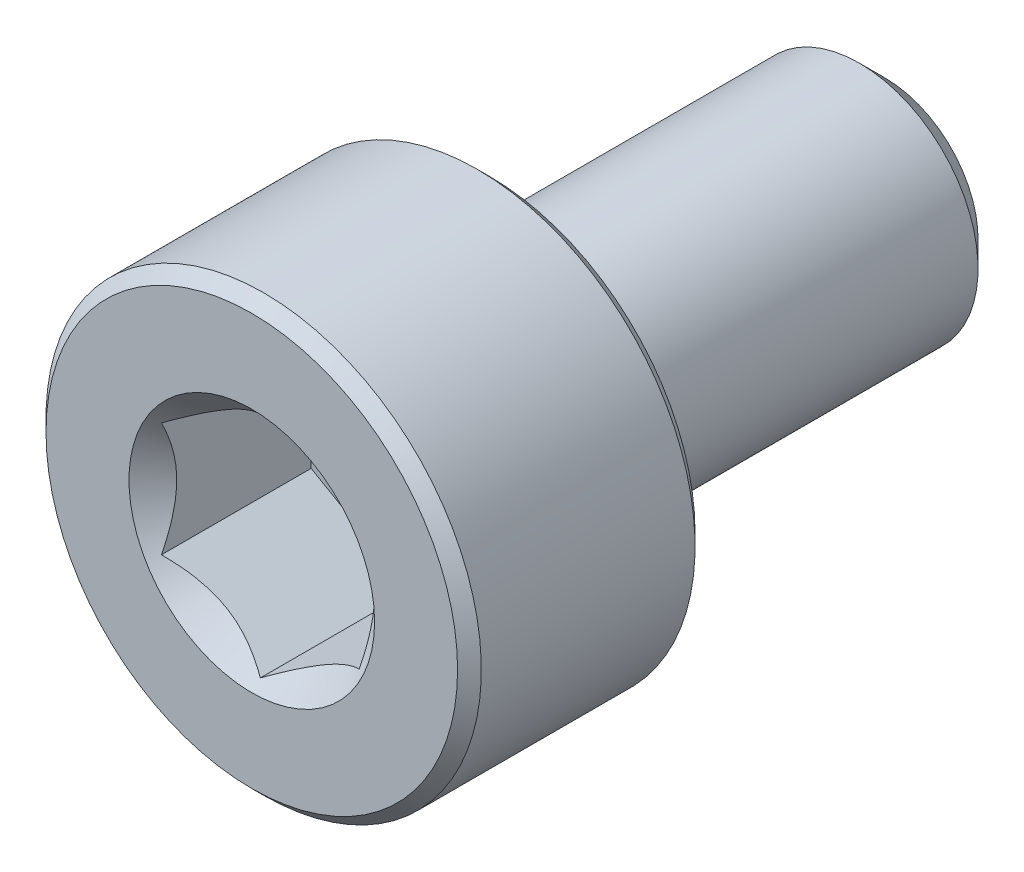
ISO-10303-21;
HEADER;
FILE_DESCRIPTION(('STEP AP214'),'2;1');
FILE_NAME('part.step','',(''),(''),'','','');
FILE_SCHEMA(('AUTOMOTIVE_DESIGN { 1 0 10303 214 1 1 1 1 }'));
ENDSEC;
DATA;
#1=APPLICATION_CONTEXT('core data for automotive mechanical design processes');
#2=APPLICATION_PROTOCOL_DEFINITION('international standard','automotive_design',2000,#1);
#3=PRODUCT_CONTEXT('',#1,'mechanical');
#4=PRODUCT('Part','Part','',(#3));
#5=PRODUCT_RELATED_PRODUCT_CATEGORY('part','',(#4));
#6=PRODUCT_DEFINITION_FORMATION('','',#4);
#7=PRODUCT_DEFINITION_CONTEXT('part definition',#1,'design');
#8=PRODUCT_DEFINITION('design','',#6,#7);
#9=PRODUCT_DEFINITION_SHAPE('','',#8);
#10=(LENGTH_UNIT() NAMED_UNIT(*) SI_UNIT(.MILLI.,.METRE.));
#11=(NAMED_UNIT(*) PLANE_ANGLE_UNIT() SI_UNIT($,.RADIAN.));
#12=(NAMED_UNIT(*) SI_UNIT($,.STERADIAN.) SOLID_ANGLE_UNIT());
#13=UNCERTAINTY_MEASURE_WITH_UNIT(LENGTH_MEASURE(1.E-05),#10,'distance_accuracy_value','');
#14=(GEOMETRIC_REPRESENTATION_CONTEXT(3) GLOBAL_UNCERTAINTY_ASSIGNED_CONTEXT((#13)) GLOBAL_UNIT_ASSIGNED_CONTEXT((#10,
#11,#12)) REPRESENTATION_CONTEXT('',''));
#15=CARTESIAN_POINT('',(0.,0.,0.));
#16=DIRECTION('',(0.,0.,1.));
#17=DIRECTION('',(1.,0.,0.));
#18=AXIS2_PLACEMENT_3D('',#15,#16,#17);
#19=CARTESIAN_POINT('',(0.,1.17524047358084,-4.));
#20=DIRECTION('',(0.,0.,-1.));
#21=DIRECTION('',(0.,1.,0.));
#22=AXIS2_PLACEMENT_3D('',#19,#20,#21);
#23=PLANE('',#22);
#24=CARTESIAN_POINT('',(0.,0.,-4.));
#25=DIRECTION('',(0.,0.,-1.));
#26=DIRECTION('',(0.,1.,0.));
#27=AXIS2_PLACEMENT_3D('',#24,#25,#26);
#28=CIRCLE('',#27,1.17524047358084);
#29=CARTESIAN_POINT('',(0.,1.17524047358084,-4.));
#30=VERTEX_POINT('',#29);
#31=EDGE_CURVE('E57',#30,#30,#28,.T.);
#32=ORIENTED_EDGE('',*,*,#31,.T.);
#33=EDGE_LOOP('',(#32));
#34=FACE_BOUND('',#33,.T.);
#35=ADVANCED_FACE('F43',(#34),#23,.T.);
#36=CARTESIAN_POINT('',(0.,0.,-4.));
#37=DIRECTION('',(0.,0.,1.));
#38=DIRECTION('',(0.,-1.,0.));
#39=AXIS2_PLACEMENT_3D('',#36,#37,#38);
#40=CONICAL_SURFACE('',#39,1.17524047358084,0.785398163397446);
#41=CARTESIAN_POINT('',(0.,0.,-3.67524047358083));
#42=DIRECTION('',(0.,0.,-1.));
#43=DIRECTION('',(0.,1.,0.));
#44=AXIS2_PLACEMENT_3D('',#41,#42,#43);
#45=CIRCLE('',#44,1.5);
#46=CARTESIAN_POINT('',(0.,1.5,-3.67524047358083));
#47=VERTEX_POINT('',#46);
#48=EDGE_CURVE('E175',#47,#47,#45,.T.);
#49=ORIENTED_EDGE('',*,*,#48,.T.);
#50=EDGE_LOOP('',(#49));
#51=FACE_BOUND('',#50,.T.);
#52=ORIENTED_EDGE('',*,*,#31,.F.);
#53=EDGE_LOOP('',(#52));
#54=FACE_BOUND('',#53,.T.);
#55=ADVANCED_FACE('F183',(#51,#54),#40,.T.);
#56=CARTESIAN_POINT('',(0.,0.,-4.));
#57=DIRECTION('',(0.,0.,-1.));
#58=DIRECTION('',(0.,1.,0.));
#59=AXIS2_PLACEMENT_3D('',#56,#57,#58);
#60=CYLINDRICAL_SURFACE('',#59,1.5);
#61=CARTESIAN_POINT('',(0.,0.,0.85));
#62=DIRECTION('',(0.,0.,-1.));
#63=DIRECTION('',(0.,1.,0.));
#64=AXIS2_PLACEMENT_3D('',#61,#62,#63);
#65=CIRCLE('',#64,1.5);
#66=CARTESIAN_POINT('',(0.,1.5,0.85));
#67=VERTEX_POINT('',#66);
#68=EDGE_CURVE('E171',#67,#67,#65,.T.);
#69=ORIENTED_EDGE('',*,*,#68,.T.);
#70=EDGE_LOOP('',(#69));
#71=FACE_BOUND('',#70,.T.);
#72=ORIENTED_EDGE('',*,*,#48,.F.);
#73=EDGE_LOOP('',(#72));
#74=FACE_BOUND('',#73,.T.);
#75=ADVANCED_FACE('F185',(#71,#74),#60,.T.);
#76=CARTESIAN_POINT('',(0.,0.,0.85));
#77=DIRECTION('',(0.,0.,-1.));
#78=DIRECTION('',(0.,1.,0.));
#79=AXIS2_PLACEMENT_3D('',#76,#77,#78);
#80=TOROIDAL_SURFACE('',#79,1.65,0.149999999999999);
#81=CARTESIAN_POINT('',(0.,0.,0.999999999999999));
#82=DIRECTION('',(0.,0.,-1.));
#83=DIRECTION('',(0.,1.,0.));
#84=AXIS2_PLACEMENT_3D('',#81,#82,#83);
#85=CIRCLE('',#84,1.65);
#86=CARTESIAN_POINT('',(0.,1.65,0.999999999999999));
#87=VERTEX_POINT('',#86);
#88=EDGE_CURVE('E167',#87,#87,#85,.T.);
#89=ORIENTED_EDGE('',*,*,#88,.T.);
#90=EDGE_LOOP('',(#89));
#91=FACE_BOUND('',#90,.T.);
#92=ORIENTED_EDGE('',*,*,#68,.F.);
#93=EDGE_LOOP('',(#92));
#94=FACE_BOUND('',#93,.T.);
#95=ADVANCED_FACE('F191',(#91,#94),#80,.F.);
#96=CARTESIAN_POINT('',(0.,2.6,1.));
#97=DIRECTION('',(0.,0.,-1.));
#98=DIRECTION('',(0.,1.,0.));
#99=AXIS2_PLACEMENT_3D('',#96,#97,#98);
#100=PLANE('',#99);
#101=CARTESIAN_POINT('',(0.,0.,1.));
#102=DIRECTION('',(0.,0.,-1.));
#103=DIRECTION('',(0.,1.,0.));
#104=AXIS2_PLACEMENT_3D('',#101,#102,#103);
#105=CIRCLE('',#104,2.6);
#106=CARTESIAN_POINT('',(0.,2.6,1.));
#107=VERTEX_POINT('',#106);
#108=EDGE_CURVE('E163',#107,#107,#105,.T.);
#109=ORIENTED_EDGE('',*,*,#108,.T.);
#110=EDGE_LOOP('',(#109));
#111=FACE_BOUND('',#110,.T.);
#112=ORIENTED_EDGE('',*,*,#88,.F.);
#113=EDGE_LOOP('',(#112));
#114=FACE_BOUND('',#113,.T.);
#115=ADVANCED_FACE('F197',(#111,#114),#100,.T.);
#116=CARTESIAN_POINT('',(0.,0.,1.));
#117=DIRECTION('',(0.,0.,1.));
#118=DIRECTION('',(0.,-1.,0.));
#119=AXIS2_PLACEMENT_3D('',#116,#117,#118);
#120=CONICAL_SURFACE('',#119,2.6,0.785398163397448);
#121=CARTESIAN_POINT('',(0.,0.,1.15));
#122=DIRECTION('',(0.,0.,-1.));
#123=DIRECTION('',(0.,1.,0.));
#124=AXIS2_PLACEMENT_3D('',#121,#122,#123);
#125=CIRCLE('',#124,2.75);
#126=CARTESIAN_POINT('',(0.,2.75,1.15));
#127=VERTEX_POINT('',#126);
#128=EDGE_CURVE('E159',#127,#127,#125,.T.);
#129=ORIENTED_EDGE('',*,*,#128,.T.);
#130=EDGE_LOOP('',(#129));
#131=FACE_BOUND('',#130,.T.);
#132=ORIENTED_EDGE('',*,*,#108,.F.);
#133=EDGE_LOOP('',(#132));
#134=FACE_BOUND('',#133,.T.);
#135=ADVANCED_FACE('F201',(#131,#134),#120,.T.);
#136=CARTESIAN_POINT('',(0.,0.,-4.));
#137=DIRECTION('',(0.,0.,-1.));
#138=DIRECTION('',(0.,1.,0.));
#139=AXIS2_PLACEMENT_3D('',#136,#137,#138);
#140=CYLINDRICAL_SURFACE('',#139,2.75);
#141=CARTESIAN_POINT('',(0.,0.,3.85));
#142=DIRECTION('',(0.,0.,-1.));
#143=DIRECTION('',(0.,1.,0.));
#144=AXIS2_PLACEMENT_3D('',#141,#142,#143);
#145=CIRCLE('',#144,2.75);
#146=CARTESIAN_POINT('',(0.,2.75,3.85));
#147=VERTEX_POINT('',#146);
#148=EDGE_CURVE('E155',#147,#147,#145,.T.);
#149=ORIENTED_EDGE('',*,*,#148,.T.);
#150=EDGE_LOOP('',(#149));
#151=FACE_BOUND('',#150,.T.);
#152=ORIENTED_EDGE('',*,*,#128,.F.);
#153=EDGE_LOOP('',(#152));
#154=FACE_BOUND('',#153,.T.);
#155=ADVANCED_FACE('F205',(#151,#154),#140,.T.);
#156=CARTESIAN_POINT('',(0.,0.,3.85));
#157=DIRECTION('',(0.,0.,-1.));
#158=DIRECTION('',(0.,1.,0.));
#159=AXIS2_PLACEMENT_3D('',#156,#157,#158);
#160=CONICAL_SURFACE('',#159,2.75,0.785398163397451);
#161=CARTESIAN_POINT('',(0.,0.,4.));
#162=DIRECTION('',(0.,0.,-1.));
#163=DIRECTION('',(0.,1.,0.));
#164=AXIS2_PLACEMENT_3D('',#161,#162,#163);
#165=CIRCLE('',#164,2.6);
#166=CARTESIAN_POINT('',(0.,2.6,4.));
#167=VERTEX_POINT('',#166);
#168=EDGE_CURVE('E151',#167,#167,#165,.T.);
#169=ORIENTED_EDGE('',*,*,#168,.T.);
#170=EDGE_LOOP('',(#169));
#171=FACE_BOUND('',#170,.T.);
#172=ORIENTED_EDGE('',*,*,#148,.F.);
#173=EDGE_LOOP('',(#172));
#174=FACE_BOUND('',#173,.T.);
#175=ADVANCED_FACE('F209',(#171,#174),#160,.T.);
#176=CARTESIAN_POINT('',(0.,0.,4.));
#177=DIRECTION('',(0.,0.,1.));
#178=DIRECTION('',(0.,-1.,0.));
#179=AXIS2_PLACEMENT_3D('',#176,#177,#178);
#180=PLANE('',#179);
#181=CARTESIAN_POINT('',(0.,0.,4.));
#182=DIRECTION('',(0.,0.,1.));
#183=DIRECTION('',(1.,0.,0.));
#184=AXIS2_PLACEMENT_3D('',#181,#182,#183);
#185=CIRCLE('',#184,1.55162884844712);
#186=CARTESIAN_POINT('',(1.55162884844712,0.,4.));
#187=VERTEX_POINT('',#186);
#188=EDGE_CURVE('E117',#187,#187,#185,.T.);
#189=ORIENTED_EDGE('',*,*,#188,.F.);
#190=EDGE_LOOP('',(#189));
#191=FACE_BOUND('',#190,.T.);
#192=ORIENTED_EDGE('',*,*,#168,.F.);
#193=EDGE_LOOP('',(#192));
#194=FACE_BOUND('',#193,.T.);
#195=ADVANCED_FACE('F213',(#191,#194),#180,.T.);
#196=CARTESIAN_POINT('',(0.,0.,4.));
#197=DIRECTION('',(0.,0.,1.));
#198=DIRECTION('',(1.,0.,0.));
#199=AXIS2_PLACEMENT_3D('',#196,#197,#198);
#200=CONICAL_SURFACE('',#199,1.55162884844712,0.78539816339745);
#201=ORIENTED_EDGE('',*,*,#188,.T.);
#202=EDGE_LOOP('',(#201));
#203=FACE_BOUND('',#202,.T.);
#204=CARTESIAN_POINT('',(-0.000199999999999194,-1.4434911430279,3.89186230843608));
#205=CARTESIAN_POINT('',(0.0427751670715876,-1.41867941875065,3.86706849258205));
#206=CARTESIAN_POINT('',(0.0864690047459489,-1.39345276980743,3.84373055894563));
#207=CARTESIAN_POINT('',(0.175565930841943,-1.34201263554194,3.80099882861148));
#208=CARTESIAN_POINT('',(0.220977498357065,-1.31579425481276,3.78162881688736));
#209=CARTESIAN_POINT('',(0.312547820935261,-1.26292610442246,3.74844730794042));
#210=CARTESIAN_POINT('',(0.358683240175886,-1.23628980770471,3.7345523835796));
#211=CARTESIAN_POINT('',(0.451970080407593,-1.18243062538508,3.71314410668758));
#212=CARTESIAN_POINT('',(0.499118649136381,-1.15520938653761,3.70561476609373));
#213=CARTESIAN_POINT('',(0.580373556887253,-1.10829684367467,3.69882132257765));
#214=CARTESIAN_POINT('',(0.614374876627942,-1.08866617256958,3.6978153836313));
#215=CARTESIAN_POINT('',(0.682317764432478,-1.04943932800611,3.69950823943826));
#216=CARTESIAN_POINT('',(0.716259317655658,-1.02984316311599,3.70220785174248));
#217=CARTESIAN_POINT('',(0.7838148564575,-0.990839954603499,3.71115575484332));
#218=CARTESIAN_POINT('',(0.817428507286776,-0.971433104248771,3.71740735042665));
#219=CARTESIAN_POINT('',(0.884094638217814,-0.932943395609905,3.73312250594085));
#220=CARTESIAN_POINT('',(0.917146871030296,-0.9138606800983,3.7425874446144));
#221=CARTESIAN_POINT('',(1.00179969160026,-0.864986351354568,3.77067821521453));
#222=CARTESIAN_POINT('',(1.05286649242964,-0.835502920149076,3.79141698197915));
#223=CARTESIAN_POINT('',(1.15300085411325,-0.777690319475909,3.83813395919842));
#224=CARTESIAN_POINT('',(1.20207431157827,-0.749357745598417,3.86409512047371));
#225=CARTESIAN_POINT('',(1.2502,-0.721572366433195,3.89186230843608));
#226=B_SPLINE_CURVE_WITH_KNOTS('',3,(#204,#205,#206,#207,#208,#209,#210,#211,#212,#213,#214,
#215,#216,#217,#218,#219,#220,#221,#222,#223,#224,#225),.UNSPECIFIED.,.F.,.F.,(4,2,2,2,2,2,2,2,
2,2,4),(0.,0.166533409618303,0.334037607289762,0.498880396489698,0.663307919240274,
0.780963963458827,0.898645970148453,1.01643764860773,1.1342799317155,1.32148652032141,
1.50809158792573),.UNSPECIFIED.);
#227=CARTESIAN_POINT('',(0.,-1.44337567297406,3.89174682452695));
#228=VERTEX_POINT('',#227);
#229=CARTESIAN_POINT('',(1.25,-0.721687836487032,3.89174682452695));
#230=VERTEX_POINT('',#229);
#231=EDGE_CURVE('E12',#228,#230,#226,.T.);
#232=ORIENTED_EDGE('',*,*,#231,.F.);
#233=CARTESIAN_POINT('',(-1.2502,-0.721572366433195,3.89186230843608));
#234=CARTESIAN_POINT('',(-1.20722483292841,-0.746384090710444,3.86706849258205));
#235=CARTESIAN_POINT('',(-1.16353099525405,-0.771610739653665,3.84373055894563));
#236=CARTESIAN_POINT('',(-1.07443406915806,-0.823050873919155,3.80099882861148));
#237=CARTESIAN_POINT('',(-1.02902250164294,-0.849269254648333,3.78162881688736));
#238=CARTESIAN_POINT('',(-0.93745217906474,-0.902137405038635,3.74844730794042));
#239=CARTESIAN_POINT('',(-0.891316759824115,-0.928773701756387,3.7345523835796));
#240=CARTESIAN_POINT('',(-0.798029919592408,-0.982632884076012,3.71314410668758));
#241=CARTESIAN_POINT('',(-0.75088135086362,-1.00985412292348,3.70561476609373));
#242=CARTESIAN_POINT('',(-0.669626443112748,-1.05676666578643,3.69882132257765));
#243=CARTESIAN_POINT('',(-0.635625123372059,-1.07639733689152,3.69781538363129));
#244=CARTESIAN_POINT('',(-0.567682235567523,-1.11562418145499,3.69950823943826));
#245=CARTESIAN_POINT('',(-0.533740682344343,-1.1352203463451,3.70220785174248));
#246=CARTESIAN_POINT('',(-0.466185143542501,-1.1742235548576,3.71115575484332));
#247=CARTESIAN_POINT('',(-0.432571492713225,-1.19363040521233,3.71740735042665));
#248=CARTESIAN_POINT('',(-0.365905361782187,-1.23212011385119,3.73312250594085));
#249=CARTESIAN_POINT('',(-0.332853128969705,-1.2512028293628,3.7425874446144));
#250=CARTESIAN_POINT('',(-0.248200308399736,-1.30007715810653,3.77067821521453));
#251=CARTESIAN_POINT('',(-0.197133507570362,-1.32956058931202,3.79141698197915));
#252=CARTESIAN_POINT('',(-0.0969991458867448,-1.38737318998519,3.83813395919842));
#253=CARTESIAN_POINT('',(-0.0479256884217301,-1.41570576386268,3.86409512047371));
#254=CARTESIAN_POINT('',(0.000200000000000837,-1.4434911430279,3.89186230843608));
#255=B_SPLINE_CURVE_WITH_KNOTS('',3,(#233,#234,#235,#236,#237,#238,#239,#240,#241,#242,#243,
#244,#245,#246,#247,#248,#249,#250,#251,#252,#253,#254),.UNSPECIFIED.,.F.,.F.,(4,2,2,2,2,2,2,2,
2,2,4),(0.,0.166533409618303,0.334037607289761,0.498880396489697,0.663307919240274,
0.780963963458826,0.898645970148452,1.01643764860773,1.13427993171549,1.32148652032141,
1.50809158792574),.UNSPECIFIED.);
#256=CARTESIAN_POINT('',(-1.25,-0.721687836487032,3.89174682452694));
#257=VERTEX_POINT('',#256);
#258=EDGE_CURVE('E102',#257,#228,#255,.T.);
#259=ORIENTED_EDGE('',*,*,#258,.F.);
#260=CARTESIAN_POINT('',(-1.25,-1.52022146239345,4.41651070319084));
#261=CARTESIAN_POINT('',(-1.25,-1.48354689134962,4.38818689718723));
#262=CARTESIAN_POINT('',(-1.25,-1.44667707589305,4.36011672093047));
#263=CARTESIAN_POINT('',(-1.25,-1.37246477804769,4.30459065501776));
#264=CARTESIAN_POINT('',(-1.25,-1.33512218721453,4.27713491044787));
#265=CARTESIAN_POINT('',(-1.25,-1.22171630832114,4.19545809771049));
#266=CARTESIAN_POINT('',(-1.25,-1.14482995781092,4.14236142511929));
#267=CARTESIAN_POINT('',(-1.25,-0.983056768942586,4.03734973416941));
#268=CARTESIAN_POINT('',(-1.25,-0.897974111811056,3.98573326925832));
#269=CARTESIAN_POINT('',(-1.25,-0.723462355215555,3.89078355108508));
#270=CARTESIAN_POINT('',(-1.25,-0.634049271919706,3.84742232185916));
#271=CARTESIAN_POINT('',(-1.25,-0.5005887711437,3.79435177040724));
#272=CARTESIAN_POINT('',(-1.25,-0.45869172620811,3.77926501327173));
#273=CARTESIAN_POINT('',(-1.25,-0.373815329706778,3.75244749770266));
#274=CARTESIAN_POINT('',(-1.25,-0.330835910419723,3.74071694982871));
#275=CARTESIAN_POINT('',(-1.25,-0.244810833071148,3.72144313304601));
#276=CARTESIAN_POINT('',(-1.25,-0.20178270746757,3.71382289169453));
#277=CARTESIAN_POINT('',(-1.25,-0.115176247984994,3.70293190707962));
#278=CARTESIAN_POINT('',(-1.25,-0.0715980347745594,3.6996602260857));
#279=CARTESIAN_POINT('',(-1.25,0.0136806197531968,3.69775210045869));
#280=CARTESIAN_POINT('',(-1.25,0.0553765370047049,3.69891205716704));
#281=CARTESIAN_POINT('',(-1.25,0.13844909645316,3.70533266388464));
#282=CARTESIAN_POINT('',(-1.25,0.179825709781942,3.71059368038276));
#283=CARTESIAN_POINT('',(-1.25,0.262662840763599,3.72500574721218));
#284=CARTESIAN_POINT('',(-1.25,0.304111120669651,3.73422600730023));
#285=CARTESIAN_POINT('',(-1.25,0.386089884230834,3.75604235623938));
#286=CARTESIAN_POINT('',(-1.25,0.426620414510369,3.76863827317792));
#287=CARTESIAN_POINT('',(-1.25,0.550794781768362,3.8120595916479));
#288=CARTESIAN_POINT('',(-1.25,0.632755591043412,3.84768282700966));
#289=CARTESIAN_POINT('',(-1.25,0.792852508946382,3.92696814455953));
#290=CARTESIAN_POINT('',(-1.25,0.870973935410876,3.97065844211049));
#291=CARTESIAN_POINT('',(-1.25,1.02031328199646,4.06088158787621));
#292=CARTESIAN_POINT('',(-1.25,1.09168171050215,4.10716845879521));
#293=CARTESIAN_POINT('',(-1.25,1.19682802849918,4.17876149953673));
#294=CARTESIAN_POINT('',(-1.25,1.2314248214359,4.20288582787532));
#295=CARTESIAN_POINT('',(-1.25,1.30014350643268,4.25178258410313));
#296=CARTESIAN_POINT('',(-1.25,1.33426552680451,4.2765548314612));
#297=CARTESIAN_POINT('',(-1.25,1.36818950249276,4.3015960474388));
#298=B_SPLINE_CURVE_WITH_KNOTS('',3,(#260,#261,#262,#263,#264,#265,#266,#267,#268,#269,#270,
#271,#272,#273,#274,#275,#276,#277,#278,#279,#280,#281,#282,#283,#284,#285,#286,#287,#288,#289,
#290,#291,#292,#293,#294,#295,#296,#297),.UNSPECIFIED.,.F.,.F.,(4,2,2,2,2,2,2,2,2,2,2,2,2,2,2,2,
2,2,4),(0.,0.139012369615044,0.278057225136918,0.55825950405377,0.856585057342474,
1.15388088887298,1.28736138903992,1.42085026158167,1.55174393609413,1.68260937990424,
1.80753647715252,1.93247473971975,2.05969207441603,2.18690293152764,2.45422704655832,
2.72250450232039,2.97756898823762,3.10409578574714,3.23058769667827),.UNSPECIFIED.);
#299=CARTESIAN_POINT('',(-1.25,0.721687836487032,3.89174682452694));
#300=VERTEX_POINT('',#299);
#301=EDGE_CURVE('E116',#300,#257,#298,.F.);
#302=ORIENTED_EDGE('',*,*,#301,.F.);
#303=CARTESIAN_POINT('',(0.000199999999999644,1.4434911430279,3.89186230843608));
#304=CARTESIAN_POINT('',(-0.0427751670715871,1.41867941875065,3.86706849258205));
#305=CARTESIAN_POINT('',(-0.0864690047459484,1.39345276980743,3.84373055894563));
#306=CARTESIAN_POINT('',(-0.175565930841942,1.34201263554194,3.80099882861148));
#307=CARTESIAN_POINT('',(-0.220977498357064,1.31579425481276,3.78162881688736));
#308=CARTESIAN_POINT('',(-0.31254782093526,1.26292610442246,3.74844730794042));
#309=CARTESIAN_POINT('',(-0.358683240175885,1.23628980770471,3.7345523835796));
#310=CARTESIAN_POINT('',(-0.451970080407592,1.18243062538508,3.71314410668758));
#311=CARTESIAN_POINT('',(-0.499118649136379,1.15520938653761,3.70561476609373));
#312=CARTESIAN_POINT('',(-0.580373556887252,1.10829684367467,3.69882132257765));
#313=CARTESIAN_POINT('',(-0.61437487662794,1.08866617256958,3.69781538363129));
#314=CARTESIAN_POINT('',(-0.682317764432477,1.04943932800611,3.69950823943826));
#315=CARTESIAN_POINT('',(-0.716259317655657,1.02984316311599,3.70220785174248));
#316=CARTESIAN_POINT('',(-0.783814856457499,0.990839954603499,3.71115575484332));
#317=CARTESIAN_POINT('',(-0.817428507286774,0.971433104248771,3.71740735042665));
#318=CARTESIAN_POINT('',(-0.884094638217812,0.932943395609906,3.73312250594085));
#319=CARTESIAN_POINT('',(-0.917146871030295,0.913860680098301,3.7425874446144));
#320=CARTESIAN_POINT('',(-1.00179969160026,0.864986351354568,3.77067821521453));
#321=CARTESIAN_POINT('',(-1.05286649242964,0.835502920149076,3.79141698197915));
#322=CARTESIAN_POINT('',(-1.15300085411325,0.777690319475908,3.83813395919842));
#323=CARTESIAN_POINT('',(-1.20207431157827,0.749357745598417,3.86409512047371));
#324=CARTESIAN_POINT('',(-1.2502,0.721572366433194,3.89186230843608));
#325=B_SPLINE_CURVE_WITH_KNOTS('',3,(#303,#304,#305,#306,#307,#308,#309,#310,#311,#312,#313,
#314,#315,#316,#317,#318,#319,#320,#321,#322,#323,#324),.UNSPECIFIED.,.F.,.F.,(4,2,2,2,2,2,2,2,
2,2,4),(0.,0.166533409618304,0.334037607289761,0.498880396489697,0.663307919240273,
0.780963963458825,0.898645970148451,1.01643764860773,1.13427993171549,1.32148652032141,
1.50809158792573),.UNSPECIFIED.);
#326=CARTESIAN_POINT('',(0.,1.44337567297406,3.89174682452694));
#327=VERTEX_POINT('',#326);
#328=EDGE_CURVE('E264',#327,#300,#325,.T.);
#329=ORIENTED_EDGE('',*,*,#328,.F.);
#330=CARTESIAN_POINT('',(1.2502,0.721572366433194,3.89186230843608));
#331=CARTESIAN_POINT('',(1.20722483292841,0.746384090710444,3.86706849258205));
#332=CARTESIAN_POINT('',(1.16353099525405,0.771610739653664,3.84373055894563));
#333=CARTESIAN_POINT('',(1.07443406915806,0.823050873919155,3.80099882861148));
#334=CARTESIAN_POINT('',(1.02902250164294,0.849269254648333,3.78162881688736));
#335=CARTESIAN_POINT('',(0.93745217906474,0.902137405038635,3.74844730794042));
#336=CARTESIAN_POINT('',(0.891316759824114,0.928773701756387,3.7345523835796));
#337=CARTESIAN_POINT('',(0.798029919592408,0.982632884076012,3.71314410668758));
#338=CARTESIAN_POINT('',(0.75088135086362,1.00985412292348,3.70561476609373));
#339=CARTESIAN_POINT('',(0.669626443112748,1.05676666578643,3.69882132257765));
#340=CARTESIAN_POINT('',(0.635625123372059,1.07639733689152,3.69781538363129));
#341=CARTESIAN_POINT('',(0.567682235567523,1.11562418145499,3.69950823943826));
#342=CARTESIAN_POINT('',(0.533740682344343,1.1352203463451,3.70220785174248));
#343=CARTESIAN_POINT('',(0.466185143542501,1.1742235548576,3.71115575484332));
#344=CARTESIAN_POINT('',(0.432571492713225,1.19363040521233,3.71740735042665));
#345=CARTESIAN_POINT('',(0.365905361782187,1.23212011385119,3.73312250594085));
#346=CARTESIAN_POINT('',(0.332853128969705,1.2512028293628,3.7425874446144));
#347=CARTESIAN_POINT('',(0.248200308399736,1.30007715810653,3.77067821521453));
#348=CARTESIAN_POINT('',(0.197133507570362,1.32956058931202,3.79141698197915));
#349=CARTESIAN_POINT('',(0.096999145886745,1.38737318998519,3.83813395919842));
#350=CARTESIAN_POINT('',(0.0479256884217302,1.41570576386268,3.86409512047371));
#351=CARTESIAN_POINT('',(-0.000200000000000388,1.4434911430279,3.89186230843608));
#352=B_SPLINE_CURVE_WITH_KNOTS('',3,(#330,#331,#332,#333,#334,#335,#336,#337,#338,#339,#340,
#341,#342,#343,#344,#345,#346,#347,#348,#349,#350,#351),.UNSPECIFIED.,.F.,.F.,(4,2,2,2,2,2,2,2,
2,2,4),(0.,0.166533409618304,0.334037607289762,0.498880396489698,0.663307919240274,
0.780963963458826,0.898645970148452,1.01643764860773,1.13427993171549,1.32148652032141,
1.50809158792574),.UNSPECIFIED.);
#353=CARTESIAN_POINT('',(1.25,0.721687836487032,3.89174682452695));
#354=VERTEX_POINT('',#353);
#355=EDGE_CURVE('E237',#354,#327,#352,.T.);
#356=ORIENTED_EDGE('',*,*,#355,.F.);
#357=CARTESIAN_POINT('',(1.25,-1.52022146239345,4.41651070319084));
#358=CARTESIAN_POINT('',(1.25,-1.48354689134962,4.38818689718723));
#359=CARTESIAN_POINT('',(1.25,-1.44667707589305,4.36011672093047));
#360=CARTESIAN_POINT('',(1.25,-1.37246477804769,4.30459065501776));
#361=CARTESIAN_POINT('',(1.25,-1.33512218721453,4.27713491044787));
#362=CARTESIAN_POINT('',(1.25,-1.22171630832114,4.19545809771049));
#363=CARTESIAN_POINT('',(1.25,-1.14482995781092,4.1423614251193));
#364=CARTESIAN_POINT('',(1.25,-0.983056768942587,4.03734973416941));
#365=CARTESIAN_POINT('',(1.25,-0.897974111811057,3.98573326925832));
#366=CARTESIAN_POINT('',(1.25,-0.723462355215556,3.89078355108508));
#367=CARTESIAN_POINT('',(1.25,-0.634049271919706,3.84742232185916));
#368=CARTESIAN_POINT('',(1.25,-0.500588771143699,3.79435177040724));
#369=CARTESIAN_POINT('',(1.25,-0.45869172620811,3.77926501327173));
#370=CARTESIAN_POINT('',(1.25,-0.373815329706778,3.75244749770266));
#371=CARTESIAN_POINT('',(1.25,-0.330835910419723,3.74071694982871));
#372=CARTESIAN_POINT('',(1.25,-0.244810833071148,3.72144313304601));
#373=CARTESIAN_POINT('',(1.25,-0.20178270746757,3.71382289169454));
#374=CARTESIAN_POINT('',(1.25,-0.115176247984994,3.70293190707962));
#375=CARTESIAN_POINT('',(1.25,-0.0715980347745594,3.6996602260857));
#376=CARTESIAN_POINT('',(1.25,0.0136806197531967,3.69775210045869));
#377=CARTESIAN_POINT('',(1.25,0.0553765370047049,3.69891205716704));
#378=CARTESIAN_POINT('',(1.25,0.13844909645316,3.70533266388464));
#379=CARTESIAN_POINT('',(1.25,0.179825709781942,3.71059368038276));
#380=CARTESIAN_POINT('',(1.25,0.262662840763599,3.72500574721218));
#381=CARTESIAN_POINT('',(1.25,0.304111120669651,3.73422600730023));
#382=CARTESIAN_POINT('',(1.25,0.386089884230834,3.75604235623938));
#383=CARTESIAN_POINT('',(1.25,0.426620414510369,3.76863827317792));
#384=CARTESIAN_POINT('',(1.25,0.550794781768362,3.8120595916479));
#385=CARTESIAN_POINT('',(1.25,0.632755591043412,3.84768282700966));
#386=CARTESIAN_POINT('',(1.25,0.792852508946383,3.92696814455953));
#387=CARTESIAN_POINT('',(1.25,0.870973935410876,3.97065844211049));
#388=CARTESIAN_POINT('',(1.25,1.02031328199646,4.06088158787621));
#389=CARTESIAN_POINT('',(1.25,1.09168171050215,4.10716845879521));
#390=CARTESIAN_POINT('',(1.25,1.19682802849918,4.17876149953674));
#391=CARTESIAN_POINT('',(1.25,1.2314248214359,4.20288582787532));
#392=CARTESIAN_POINT('',(1.25,1.30014350643268,4.25178258410313));
#393=CARTESIAN_POINT('',(1.25,1.33426552680451,4.2765548314612));
#394=CARTESIAN_POINT('',(1.25,1.36818950249276,4.3015960474388));
#395=B_SPLINE_CURVE_WITH_KNOTS('',3,(#357,#358,#359,#360,#361,#362,#363,#364,#365,#366,#367,
#368,#369,#370,#371,#372,#373,#374,#375,#376,#377,#378,#379,#380,#381,#382,#383,#384,#385,#386,
#387,#388,#389,#390,#391,#392,#393,#394),.UNSPECIFIED.,.F.,.F.,(4,2,2,2,2,2,2,2,2,2,2,2,2,2,2,2,
2,2,4),(0.,0.139012369615044,0.278057225136918,0.558259504053771,0.856585057342474,
1.15388088887299,1.28736138903992,1.42085026158168,1.55174393609413,1.68260937990424,
1.80753647715252,1.93247473971975,2.05969207441603,2.18690293152764,2.45422704655832,
2.72250450232039,2.97756898823763,3.10409578574714,3.23058769667827),.UNSPECIFIED.);
#396=EDGE_CURVE('E64',#230,#354,#395,.T.);
#397=ORIENTED_EDGE('',*,*,#396,.F.);
#398=EDGE_LOOP('',(#232,#259,#302,#329,#356,#397));
#399=FACE_BOUND('',#398,.T.);
#400=ADVANCED_FACE('F101',(#203,#399),#200,.F.);
#401=CARTESIAN_POINT('',(0.,2.6,2.));
#402=DIRECTION('',(0.,0.,-1.));
#403=DIRECTION('',(0.,1.,0.));
#404=AXIS2_PLACEMENT_3D('',#401,#402,#403);
#405=PLANE('',#404);
#406=DIRECTION('',(0.866025403784439,0.5,0.));
#407=VECTOR('',#406,1.);
#408=CARTESIAN_POINT('',(0.,-1.44337567297406,2.));
#409=LINE('',#408,#407);
#410=CARTESIAN_POINT('',(0.,-1.44337567297406,2.));
#411=VERTEX_POINT('',#410);
#412=CARTESIAN_POINT('',(1.25,-0.721687836487032,2.));
#413=VERTEX_POINT('',#412);
#414=EDGE_CURVE('E120',#411,#413,#409,.T.);
#415=ORIENTED_EDGE('',*,*,#414,.T.);
#416=DIRECTION('',(0.,1.,0.));
#417=VECTOR('',#416,1.);
#418=CARTESIAN_POINT('',(1.25,-0.721687836487032,2.));
#419=LINE('',#418,#417);
#420=CARTESIAN_POINT('',(1.25,0.721687836487032,2.));
#421=VERTEX_POINT('',#420);
#422=EDGE_CURVE('E71',#413,#421,#419,.T.);
#423=ORIENTED_EDGE('',*,*,#422,.T.);
#424=DIRECTION('',(-0.866025403784439,0.5,0.));
#425=VECTOR('',#424,1.);
#426=CARTESIAN_POINT('',(1.25,0.721687836487032,2.));
#427=LINE('',#426,#425);
#428=CARTESIAN_POINT('',(0.,1.44337567297406,2.));
#429=VERTEX_POINT('',#428);
#430=EDGE_CURVE('E131',#421,#429,#427,.T.);
#431=ORIENTED_EDGE('',*,*,#430,.T.);
#432=DIRECTION('',(-0.866025403784439,-0.5,0.));
#433=VECTOR('',#432,1.);
#434=CARTESIAN_POINT('',(0.,1.44337567297406,2.));
#435=LINE('',#434,#433);
#436=CARTESIAN_POINT('',(-1.25,0.721687836487032,2.));
#437=VERTEX_POINT('',#436);
#438=EDGE_CURVE('E140',#429,#437,#435,.T.);
#439=ORIENTED_EDGE('',*,*,#438,.T.);
#440=DIRECTION('',(0.,-1.,0.));
#441=VECTOR('',#440,1.);
#442=CARTESIAN_POINT('',(-1.25,0.721687836487032,2.));
#443=LINE('',#442,#441);
#444=CARTESIAN_POINT('',(-1.25,-0.721687836487033,2.));
#445=VERTEX_POINT('',#444);
#446=EDGE_CURVE('E135',#437,#445,#443,.T.);
#447=ORIENTED_EDGE('',*,*,#446,.T.);
#448=DIRECTION('',(0.866025403784439,-0.5,0.));
#449=VECTOR('',#448,1.);
#450=CARTESIAN_POINT('',(-1.25,-0.721687836487032,2.));
#451=LINE('',#450,#449);
#452=EDGE_CURVE('E122',#445,#411,#451,.T.);
#453=ORIENTED_EDGE('',*,*,#452,.T.);
#454=EDGE_LOOP('',(#415,#423,#431,#439,#447,#453));
#455=FACE_BOUND('',#454,.T.);
#456=ADVANCED_FACE('F218',(#455),#405,.F.);
#457=CARTESIAN_POINT('',(0.,-1.44337567297406,-2.81881307912987));
#458=DIRECTION('',(0.5,-0.866025403784438,0.));
#459=DIRECTION('',(0.866025403784439,0.5,0.));
#460=AXIS2_PLACEMENT_3D('',#457,#458,#459);
#461=PLANE('',#460);
#462=DIRECTION('',(0.,0.,1.));
#463=VECTOR('',#462,1.);
#464=CARTESIAN_POINT('',(0.,-1.44337567297406,-2.81881307912987));
#465=LINE('',#464,#463);
#466=EDGE_CURVE('E111',#411,#228,#465,.T.);
#467=ORIENTED_EDGE('',*,*,#466,.T.);
#468=ORIENTED_EDGE('',*,*,#231,.T.);
#469=DIRECTION('',(0.,0.,1.));
#470=VECTOR('',#469,1.);
#471=CARTESIAN_POINT('',(1.25,-0.721687836487032,-2.81881307912987));
#472=LINE('',#471,#470);
#473=EDGE_CURVE('E126',#413,#230,#472,.T.);
#474=ORIENTED_EDGE('',*,*,#473,.F.);
#475=ORIENTED_EDGE('',*,*,#414,.F.);
#476=EDGE_LOOP('',(#467,#468,#474,#475));
#477=FACE_BOUND('',#476,.T.);
#478=ADVANCED_FACE('F119',(#477),#461,.F.);
#479=CARTESIAN_POINT('',(-1.25,-0.721687836487032,-2.81881307912987));
#480=DIRECTION('',(-0.5,-0.866025403784439,0.));
#481=DIRECTION('',(0.866025403784439,-0.5,0.));
#482=AXIS2_PLACEMENT_3D('',#479,#480,#481);
#483=PLANE('',#482);
#484=DIRECTION('',(0.,0.,1.));
#485=VECTOR('',#484,1.);
#486=CARTESIAN_POINT('',(-1.25,-0.721687836487032,-2.81881307912987));
#487=LINE('',#486,#485);
#488=EDGE_CURVE('E114',#445,#257,#487,.T.);
#489=ORIENTED_EDGE('',*,*,#488,.T.);
#490=ORIENTED_EDGE('',*,*,#258,.T.);
#491=ORIENTED_EDGE('',*,*,#466,.F.);
#492=ORIENTED_EDGE('',*,*,#452,.F.);
#493=EDGE_LOOP('',(#489,#490,#491,#492));
#494=FACE_BOUND('',#493,.T.);
#495=ADVANCED_FACE('F110',(#494),#483,.F.);
#496=CARTESIAN_POINT('',(-1.25,0.721687836487032,-2.81881307912987));
#497=DIRECTION('',(-1.,0.,0.));
#498=DIRECTION('',(0.,0.,1.));
#499=AXIS2_PLACEMENT_3D('',#496,#497,#498);
#500=PLANE('',#499);
#501=DIRECTION('',(0.,0.,1.));
#502=VECTOR('',#501,1.);
#503=CARTESIAN_POINT('',(-1.25,0.721687836487032,-2.81881307912987));
#504=LINE('',#503,#502);
#505=EDGE_CURVE('E136',#437,#300,#504,.T.);
#506=ORIENTED_EDGE('',*,*,#505,.T.);
#507=ORIENTED_EDGE('',*,*,#301,.T.);
#508=ORIENTED_EDGE('',*,*,#488,.F.);
#509=ORIENTED_EDGE('',*,*,#446,.F.);
#510=EDGE_LOOP('',(#506,#507,#508,#509));
#511=FACE_BOUND('',#510,.T.);
#512=ADVANCED_FACE('F274',(#511),#500,.F.);
#513=CARTESIAN_POINT('',(0.,1.44337567297406,-2.81881307912987));
#514=DIRECTION('',(-0.5,0.866025403784438,0.));
#515=DIRECTION('',(-0.866025403784439,-0.5,0.));
#516=AXIS2_PLACEMENT_3D('',#513,#514,#515);
#517=PLANE('',#516);
#518=DIRECTION('',(0.,0.,1.));
#519=VECTOR('',#518,1.);
#520=CARTESIAN_POINT('',(0.,1.44337567297406,-2.81881307912987));
#521=LINE('',#520,#519);
#522=EDGE_CURVE('E141',#429,#327,#521,.T.);
#523=ORIENTED_EDGE('',*,*,#522,.T.);
#524=ORIENTED_EDGE('',*,*,#328,.T.);
#525=ORIENTED_EDGE('',*,*,#505,.F.);
#526=ORIENTED_EDGE('',*,*,#438,.F.);
#527=EDGE_LOOP('',(#523,#524,#525,#526));
#528=FACE_BOUND('',#527,.T.);
#529=ADVANCED_FACE('F271',(#528),#517,.F.);
#530=CARTESIAN_POINT('',(1.25,0.721687836487032,-2.81881307912987));
#531=DIRECTION('',(0.5,0.866025403784439,0.));
#532=DIRECTION('',(-0.866025403784439,0.5,0.));
#533=AXIS2_PLACEMENT_3D('',#530,#531,#532);
#534=PLANE('',#533);
#535=DIRECTION('',(0.,0.,1.));
#536=VECTOR('',#535,1.);
#537=CARTESIAN_POINT('',(1.25,0.721687836487032,-2.81881307912987));
#538=LINE('',#537,#536);
#539=EDGE_CURVE('E145',#421,#354,#538,.T.);
#540=ORIENTED_EDGE('',*,*,#539,.T.);
#541=ORIENTED_EDGE('',*,*,#355,.T.);
#542=ORIENTED_EDGE('',*,*,#522,.F.);
#543=ORIENTED_EDGE('',*,*,#430,.F.);
#544=EDGE_LOOP('',(#540,#541,#542,#543));
#545=FACE_BOUND('',#544,.T.);
#546=ADVANCED_FACE('F226',(#545),#534,.F.);
#547=CARTESIAN_POINT('',(1.25,-0.721687836487032,-2.81881307912987));
#548=DIRECTION('',(1.,0.,0.));
#549=DIRECTION('',(0.,0.,-1.));
#550=AXIS2_PLACEMENT_3D('',#547,#548,#549);
#551=PLANE('',#550);
#552=ORIENTED_EDGE('',*,*,#473,.T.);
#553=ORIENTED_EDGE('',*,*,#396,.T.);
#554=ORIENTED_EDGE('',*,*,#539,.F.);
#555=ORIENTED_EDGE('',*,*,#422,.F.);
#556=EDGE_LOOP('',(#552,#553,#554,#555));
#557=FACE_BOUND('',#556,.T.);
#558=ADVANCED_FACE('F222',(#557),#551,.F.);
#559=CLOSED_SHELL('',(#35,#55,#75,#95,#115,#135,#155,#175,#195,#400,#456,#478,#495,#512,#529,
#546,#558));
#560=MANIFOLD_SOLID_BREP('B2',#559);
#561=ADVANCED_BREP_SHAPE_REPRESENTATION('',(#18,#560),#14);
#562=SHAPE_DEFINITION_REPRESENTATION(#9,#561);
ENDSEC;
END-ISO-10303-21;
